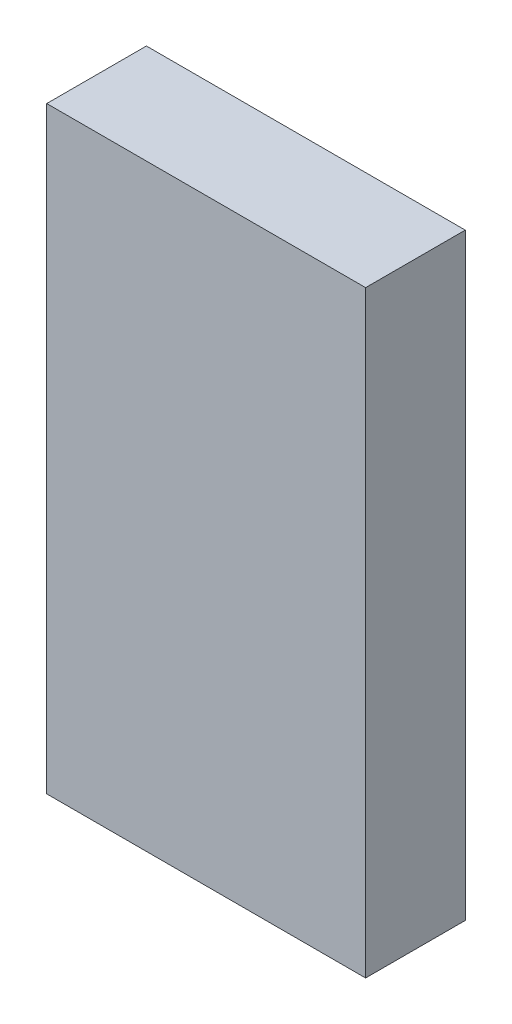
ISO-10303-21;
HEADER;
FILE_DESCRIPTION(('STEP AP214'),'2;1');
FILE_NAME('part.step','',(''),(''),'','','');
FILE_SCHEMA(('AUTOMOTIVE_DESIGN { 1 0 10303 214 1 1 1 1 }'));
ENDSEC;
DATA;
#1=APPLICATION_CONTEXT('core data for automotive mechanical design processes');
#2=APPLICATION_PROTOCOL_DEFINITION('international standard','automotive_design',2000,#1);
#3=PRODUCT_CONTEXT('',#1,'mechanical');
#4=PRODUCT('Part','Part','',(#3));
#5=PRODUCT_RELATED_PRODUCT_CATEGORY('part','',(#4));
#6=PRODUCT_DEFINITION_FORMATION('','',#4);
#7=PRODUCT_DEFINITION_CONTEXT('part definition',#1,'design');
#8=PRODUCT_DEFINITION('design','',#6,#7);
#9=PRODUCT_DEFINITION_SHAPE('','',#8);
#10=(LENGTH_UNIT() NAMED_UNIT(*) SI_UNIT(.MILLI.,.METRE.));
#11=(NAMED_UNIT(*) PLANE_ANGLE_UNIT() SI_UNIT($,.RADIAN.));
#12=(NAMED_UNIT(*) SI_UNIT($,.STERADIAN.) SOLID_ANGLE_UNIT());
#13=UNCERTAINTY_MEASURE_WITH_UNIT(LENGTH_MEASURE(1.E-05),#10,'distance_accuracy_value','');
#14=(GEOMETRIC_REPRESENTATION_CONTEXT(3) GLOBAL_UNCERTAINTY_ASSIGNED_CONTEXT((#13)) GLOBAL_UNIT_ASSIGNED_CONTEXT((#10,
#11,#12)) REPRESENTATION_CONTEXT('',''));
#15=CARTESIAN_POINT('',(0.,0.,0.));
#16=DIRECTION('',(0.,0.,1.));
#17=DIRECTION('',(1.,0.,0.));
#18=AXIS2_PLACEMENT_3D('',#15,#16,#17);
#19=CARTESIAN_POINT('',(-2.79999948,-5.24999966,1.75000158));
#20=DIRECTION('',(0.,0.,1.));
#21=DIRECTION('',(1.,0.,0.));
#22=AXIS2_PLACEMENT_3D('',#19,#20,#21);
#23=PLANE('',#22);
#24=DIRECTION('',(1.,0.,0.));
#25=VECTOR('',#24,1.);
#26=CARTESIAN_POINT('',(-2.79999948,5.24999966,1.75000158));
#27=LINE('',#26,#25);
#28=CARTESIAN_POINT('',(-2.79999948,5.24999966,1.75000158));
#29=VERTEX_POINT('',#28);
#30=CARTESIAN_POINT('',(2.79999948,5.24999966,1.75000158));
#31=VERTEX_POINT('',#30);
#32=EDGE_CURVE('E53',#29,#31,#27,.T.);
#33=ORIENTED_EDGE('',*,*,#32,.F.);
#34=DIRECTION('',(0.,1.,0.));
#35=VECTOR('',#34,1.);
#36=CARTESIAN_POINT('',(-2.79999948,-5.24999966,1.75000158));
#37=LINE('',#36,#35);
#38=CARTESIAN_POINT('',(-2.79999948,-5.24999966,1.75000158));
#39=VERTEX_POINT('',#38);
#40=EDGE_CURVE('E68',#39,#29,#37,.T.);
#41=ORIENTED_EDGE('',*,*,#40,.F.);
#42=DIRECTION('',(1.,0.,0.));
#43=VECTOR('',#42,1.);
#44=CARTESIAN_POINT('',(2.79999948,-5.24999966,1.75000158));
#45=LINE('',#44,#43);
#46=CARTESIAN_POINT('',(2.79999948,-5.24999966,1.75000158));
#47=VERTEX_POINT('',#46);
#48=EDGE_CURVE('E20',#47,#39,#45,.F.);
#49=ORIENTED_EDGE('',*,*,#48,.F.);
#50=DIRECTION('',(0.,1.,0.));
#51=VECTOR('',#50,1.);
#52=CARTESIAN_POINT('',(2.79999948,5.24999966,1.75000158));
#53=LINE('',#52,#51);
#54=EDGE_CURVE('E58',#31,#47,#53,.F.);
#55=ORIENTED_EDGE('',*,*,#54,.F.);
#56=EDGE_LOOP('',(#33,#41,#49,#55));
#57=FACE_BOUND('',#56,.T.);
#58=ADVANCED_FACE('F17',(#57),#23,.T.);
#59=CARTESIAN_POINT('',(2.79999948,-5.24999966,0.));
#60=DIRECTION('',(0.,-1.,0.));
#61=DIRECTION('',(0.,0.,-1.));
#62=AXIS2_PLACEMENT_3D('',#59,#60,#61);
#63=PLANE('',#62);
#64=DIRECTION('',(0.,0.,1.));
#65=VECTOR('',#64,1.);
#66=CARTESIAN_POINT('',(-2.79999948,-5.24999966,0.));
#67=LINE('',#66,#65);
#68=CARTESIAN_POINT('',(-2.79999948,-5.24999966,0.));
#69=VERTEX_POINT('',#68);
#70=EDGE_CURVE('E79',#69,#39,#67,.T.);
#71=ORIENTED_EDGE('',*,*,#70,.F.);
#72=DIRECTION('',(1.,0.,0.));
#73=VECTOR('',#72,1.);
#74=CARTESIAN_POINT('',(-2.79999948,-5.24999966,0.));
#75=LINE('',#74,#73);
#76=CARTESIAN_POINT('',(2.79999948,-5.24999966,0.));
#77=VERTEX_POINT('',#76);
#78=EDGE_CURVE('E74',#69,#77,#75,.T.);
#79=ORIENTED_EDGE('',*,*,#78,.T.);
#80=DIRECTION('',(0.,0.,-1.));
#81=VECTOR('',#80,1.);
#82=CARTESIAN_POINT('',(2.79999948,-5.24999966,0.));
#83=LINE('',#82,#81);
#84=EDGE_CURVE('E63',#47,#77,#83,.T.);
#85=ORIENTED_EDGE('',*,*,#84,.F.);
#86=ORIENTED_EDGE('',*,*,#48,.T.);
#87=EDGE_LOOP('',(#71,#79,#85,#86));
#88=FACE_BOUND('',#87,.T.);
#89=ADVANCED_FACE('F73',(#88),#63,.T.);
#90=CARTESIAN_POINT('',(2.79999948,5.24999966,0.));
#91=DIRECTION('',(1.,0.,0.));
#92=DIRECTION('',(0.,0.,-1.));
#93=AXIS2_PLACEMENT_3D('',#90,#91,#92);
#94=PLANE('',#93);
#95=ORIENTED_EDGE('',*,*,#84,.T.);
#96=DIRECTION('',(0.,1.,0.));
#97=VECTOR('',#96,1.);
#98=CARTESIAN_POINT('',(2.79999948,-5.24999966,0.));
#99=LINE('',#98,#97);
#100=CARTESIAN_POINT('',(2.79999948,5.24999966,0.));
#101=VERTEX_POINT('',#100);
#102=EDGE_CURVE('E84',#77,#101,#99,.T.);
#103=ORIENTED_EDGE('',*,*,#102,.T.);
#104=DIRECTION('',(0.,0.,1.));
#105=VECTOR('',#104,1.);
#106=CARTESIAN_POINT('',(2.79999948,5.24999966,0.));
#107=LINE('',#106,#105);
#108=EDGE_CURVE('E65',#31,#101,#107,.F.);
#109=ORIENTED_EDGE('',*,*,#108,.F.);
#110=ORIENTED_EDGE('',*,*,#54,.T.);
#111=EDGE_LOOP('',(#95,#103,#109,#110));
#112=FACE_BOUND('',#111,.T.);
#113=ADVANCED_FACE('F60',(#112),#94,.T.);
#114=CARTESIAN_POINT('',(-2.79999948,5.24999966,0.));
#115=DIRECTION('',(0.,1.,0.));
#116=DIRECTION('',(0.,0.,1.));
#117=AXIS2_PLACEMENT_3D('',#114,#115,#116);
#118=PLANE('',#117);
#119=ORIENTED_EDGE('',*,*,#108,.T.);
#120=DIRECTION('',(1.,0.,0.));
#121=VECTOR('',#120,1.);
#122=CARTESIAN_POINT('',(-2.79999948,5.24999966,0.));
#123=LINE('',#122,#121);
#124=CARTESIAN_POINT('',(-2.79999948,5.24999966,0.));
#125=VERTEX_POINT('',#124);
#126=EDGE_CURVE('E26',#101,#125,#123,.F.);
#127=ORIENTED_EDGE('',*,*,#126,.T.);
#128=DIRECTION('',(0.,0.,1.));
#129=VECTOR('',#128,1.);
#130=CARTESIAN_POINT('',(-2.79999948,5.24999966,0.));
#131=LINE('',#130,#129);
#132=EDGE_CURVE('E34',#29,#125,#131,.F.);
#133=ORIENTED_EDGE('',*,*,#132,.F.);
#134=ORIENTED_EDGE('',*,*,#32,.T.);
#135=EDGE_LOOP('',(#119,#127,#133,#134));
#136=FACE_BOUND('',#135,.T.);
#137=ADVANCED_FACE('F88',(#136),#118,.T.);
#138=CARTESIAN_POINT('',(-2.79999948,-5.24999966,0.));
#139=DIRECTION('',(-1.,0.,0.));
#140=DIRECTION('',(0.,0.,1.));
#141=AXIS2_PLACEMENT_3D('',#138,#139,#140);
#142=PLANE('',#141);
#143=ORIENTED_EDGE('',*,*,#132,.T.);
#144=DIRECTION('',(0.,1.,0.));
#145=VECTOR('',#144,1.);
#146=CARTESIAN_POINT('',(-2.79999948,-5.24999966,0.));
#147=LINE('',#146,#145);
#148=EDGE_CURVE('E11',#125,#69,#147,.F.);
#149=ORIENTED_EDGE('',*,*,#148,.T.);
#150=ORIENTED_EDGE('',*,*,#70,.T.);
#151=ORIENTED_EDGE('',*,*,#40,.T.);
#152=EDGE_LOOP('',(#143,#149,#150,#151));
#153=FACE_BOUND('',#152,.T.);
#154=ADVANCED_FACE('F91',(#153),#142,.T.);
#155=CARTESIAN_POINT('',(-2.79999948,-5.24999966,0.));
#156=DIRECTION('',(0.,0.,1.));
#157=DIRECTION('',(1.,0.,0.));
#158=AXIS2_PLACEMENT_3D('',#155,#156,#157);
#159=PLANE('',#158);
#160=ORIENTED_EDGE('',*,*,#126,.F.);
#161=ORIENTED_EDGE('',*,*,#102,.F.);
#162=ORIENTED_EDGE('',*,*,#78,.F.);
#163=ORIENTED_EDGE('',*,*,#148,.F.);
#164=EDGE_LOOP('',(#160,#161,#162,#163));
#165=FACE_BOUND('',#164,.T.);
#166=ADVANCED_FACE('F90',(#165),#159,.F.);
#167=CLOSED_SHELL('',(#58,#89,#113,#137,#154,#166));
#168=MANIFOLD_SOLID_BREP('B1',#167);
#169=ADVANCED_BREP_SHAPE_REPRESENTATION('',(#18,#168),#14);
#170=SHAPE_DEFINITION_REPRESENTATION(#9,#169);
ENDSEC;
END-ISO-10303-21;
